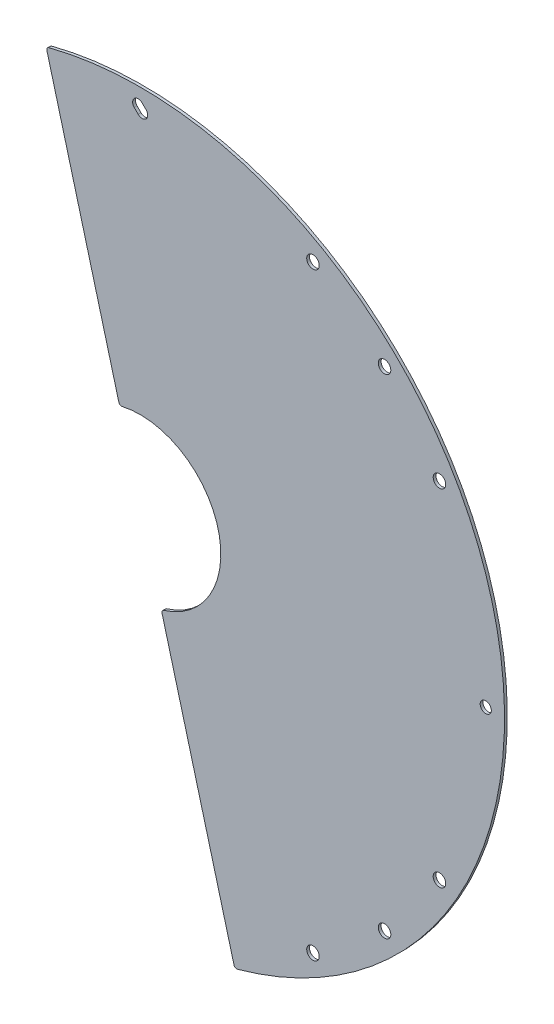
ISO-10303-21;
HEADER;
FILE_DESCRIPTION(('STEP AP214'),'2;1');
FILE_NAME('part.step','',(''),(''),'','','');
FILE_SCHEMA(('AUTOMOTIVE_DESIGN { 1 0 10303 214 1 1 1 1 }'));
ENDSEC;
DATA;
#1=APPLICATION_CONTEXT('core data for automotive mechanical design processes');
#2=APPLICATION_PROTOCOL_DEFINITION('international standard','automotive_design',2000,#1);
#3=PRODUCT_CONTEXT('',#1,'mechanical');
#4=PRODUCT('Part','Part','',(#3));
#5=PRODUCT_RELATED_PRODUCT_CATEGORY('part','',(#4));
#6=PRODUCT_DEFINITION_FORMATION('','',#4);
#7=PRODUCT_DEFINITION_CONTEXT('part definition',#1,'design');
#8=PRODUCT_DEFINITION('design','',#6,#7);
#9=PRODUCT_DEFINITION_SHAPE('','',#8);
#10=(LENGTH_UNIT() NAMED_UNIT(*) SI_UNIT(.MILLI.,.METRE.));
#11=(NAMED_UNIT(*) PLANE_ANGLE_UNIT() SI_UNIT($,.RADIAN.));
#12=(NAMED_UNIT(*) SI_UNIT($,.STERADIAN.) SOLID_ANGLE_UNIT());
#13=UNCERTAINTY_MEASURE_WITH_UNIT(LENGTH_MEASURE(1.E-05),#10,'distance_accuracy_value','');
#14=(GEOMETRIC_REPRESENTATION_CONTEXT(3) GLOBAL_UNCERTAINTY_ASSIGNED_CONTEXT((#13)) GLOBAL_UNIT_ASSIGNED_CONTEXT((#10,
#11,#12)) REPRESENTATION_CONTEXT('',''));
#15=CARTESIAN_POINT('',(0.,0.,0.));
#16=DIRECTION('',(0.,0.,1.));
#17=DIRECTION('',(1.,0.,0.));
#18=AXIS2_PLACEMENT_3D('',#15,#16,#17);
#19=CARTESIAN_POINT('',(-33.9052949084303,126.536283243868,0.999999999999994));
#20=DIRECTION('',(0.,0.,1.));
#21=DIRECTION('',(1.,0.,0.));
#22=AXIS2_PLACEMENT_3D('',#19,#20,#21);
#23=PLANE('',#22);
#24=CARTESIAN_POINT('',(0.,0.,0.999999999999987));
#25=DIRECTION('',(0.,0.,-1.));
#26=DIRECTION('',(-1.,0.,0.));
#27=AXIS2_PLACEMENT_3D('',#24,#25,#26);
#28=CIRCLE('',#27,29.);
#29=CARTESIAN_POINT('',(-6.473603948856,28.2682233596906,0.999999999999987));
#30=VERTEX_POINT('',#29);
#31=CARTESIAN_POINT('',(8.52780620609657,-27.7178015237728,0.999999999999987));
#32=VERTEX_POINT('',#31);
#33=EDGE_CURVE('E214',#30,#32,#28,.T.);
#34=ORIENTED_EDGE('',*,*,#33,.T.);
#35=CARTESIAN_POINT('',(8.82186848906542,-28.6735877832132,0.999999999999994));
#36=DIRECTION('',(0.,0.,1.));
#37=DIRECTION('',(1.,0.,0.));
#38=AXIS2_PLACEMENT_3D('',#35,#36,#37);
#39=CIRCLE('',#38,1.);
#40=CARTESIAN_POINT('',(7.85594266277633,-28.9324068283157,0.999999999999994));
#41=VERTEX_POINT('',#40);
#42=EDGE_CURVE('E238',#32,#41,#39,.T.);
#43=ORIENTED_EDGE('',*,*,#42,.T.);
#44=DIRECTION('',(-0.258819045102518,0.965925826289069,0.));
#45=VECTOR('',#44,1.);
#46=CARTESIAN_POINT('',(-33.8087023258014,126.562165148378,0.999999999999994));
#47=LINE('',#46,#45);
#48=CARTESIAN_POINT('',(33.7418639203775,-125.539980162412,0.999999999999994));
#49=VERTEX_POINT('',#48);
#50=EDGE_CURVE('E268',#49,#41,#47,.T.);
#51=ORIENTED_EDGE('',*,*,#50,.F.);
#52=CARTESIAN_POINT('',(34.7077897466666,-125.281161117309,0.999999999999994));
#53=DIRECTION('',(0.,0.,1.));
#54=DIRECTION('',(1.,0.,0.));
#55=AXIS2_PLACEMENT_3D('',#52,#53,#54);
#56=CIRCLE('',#55,1.);
#57=CARTESIAN_POINT('',(34.9747727447179,-126.244862356673,1.));
#58=VERTEX_POINT('',#57);
#59=EDGE_CURVE('E234',#49,#58,#56,.T.);
#60=ORIENTED_EDGE('',*,*,#59,.T.);
#61=CARTESIAN_POINT('',(0.,0.,1.));
#62=DIRECTION('',(0.,0.,-1.));
#63=DIRECTION('',(-1.,0.,0.));
#64=AXIS2_PLACEMENT_3D('',#61,#62,#63);
#65=CIRCLE('',#64,131.);
#66=CARTESIAN_POINT('',(-32.8333894898225,126.818644270508,1.));
#67=VERTEX_POINT('',#66);
#68=EDGE_CURVE('E223',#67,#58,#65,.T.);
#69=ORIENTED_EDGE('',*,*,#68,.F.);
#70=CARTESIAN_POINT('',(-32.5827529288315,125.850563016535,0.999999999999994));
#71=DIRECTION('',(0.,0.,1.));
#72=DIRECTION('',(1.,0.,0.));
#73=AXIS2_PLACEMENT_3D('',#70,#71,#72);
#74=CIRCLE('',#73,1.);
#75=CARTESIAN_POINT('',(-33.5486787551206,125.591743971432,0.999999999999994));
#76=VERTEX_POINT('',#75);
#77=EDGE_CURVE('E232',#67,#76,#74,.T.);
#78=ORIENTED_EDGE('',*,*,#77,.T.);
#79=CARTESIAN_POINT('',(-7.66275749751943,28.984170637336,0.999999999999994));
#80=VERTEX_POINT('',#79);
#81=EDGE_CURVE('E155',#80,#76,#47,.T.);
#82=ORIENTED_EDGE('',*,*,#81,.F.);
#83=CARTESIAN_POINT('',(-6.69683167123034,29.2429896824385,0.999999999999994));
#84=DIRECTION('',(0.,0.,1.));
#85=DIRECTION('',(1.,0.,0.));
#86=AXIS2_PLACEMENT_3D('',#83,#84,#85);
#87=CIRCLE('',#86,1.);
#88=EDGE_CURVE('E236',#80,#30,#87,.T.);
#89=ORIENTED_EDGE('',*,*,#88,.T.);
#90=EDGE_LOOP('',(#34,#43,#51,#60,#69,#78,#82,#89));
#91=FACE_BOUND('',#90,.T.);
#92=DIRECTION('',(-0.707106781186549,0.707106781186546,0.));
#93=VECTOR('',#92,1.);
#94=CARTESIAN_POINT('',(0.70710678118611,126.37132034356,0.999999999999994));
#95=LINE('',#94,#93);
#96=CARTESIAN_POINT('',(2.12132034355921,124.957106781187,0.999999999999994));
#97=VERTEX_POINT('',#96);
#98=CARTESIAN_POINT('',(0.70710678118611,126.37132034356,0.999999999999994));
#99=VERTEX_POINT('',#98);
#100=EDGE_CURVE('E150',#97,#99,#95,.T.);
#101=ORIENTED_EDGE('',*,*,#100,.F.);
#102=CARTESIAN_POINT('',(0.707106781186083,123.542893218813,0.999999999999994));
#103=DIRECTION('',(0.,0.,1.));
#104=DIRECTION('',(1.,0.,0.));
#105=AXIS2_PLACEMENT_3D('',#102,#103,#104);
#106=CIRCLE('',#105,1.99999999999999);
#107=CARTESIAN_POINT('',(-0.707106781187008,122.12867965644,0.999999999999994));
#108=VERTEX_POINT('',#107);
#109=EDGE_CURVE('E152',#108,#97,#106,.T.);
#110=ORIENTED_EDGE('',*,*,#109,.F.);
#111=DIRECTION('',(0.707106781186547,-0.707106781186547,0.));
#112=VECTOR('',#111,1.);
#113=CARTESIAN_POINT('',(-2.12132034356007,123.542893218813,0.999999999999994));
#114=LINE('',#113,#112);
#115=CARTESIAN_POINT('',(-2.12132034356007,123.542893218813,0.999999999999994));
#116=VERTEX_POINT('',#115);
#117=EDGE_CURVE('E161',#116,#108,#114,.T.);
#118=ORIENTED_EDGE('',*,*,#117,.F.);
#119=CARTESIAN_POINT('',(-0.707106781187007,124.957106781187,0.999999999999994));
#120=DIRECTION('',(0.,0.,1.));
#121=DIRECTION('',(1.,0.,0.));
#122=AXIS2_PLACEMENT_3D('',#119,#120,#121);
#123=CIRCLE('',#122,1.99999999999999);
#124=EDGE_CURVE('E144',#99,#116,#123,.T.);
#125=ORIENTED_EDGE('',*,*,#124,.F.);
#126=EDGE_LOOP('',(#101,#110,#118,#125));
#127=FACE_BOUND('',#126,.T.);
#128=CARTESIAN_POINT('',(87.8580175624287,-87.8580175624283,0.999999999999995));
#129=DIRECTION('',(0.,0.,1.));
#130=DIRECTION('',(1.,0.,0.));
#131=AXIS2_PLACEMENT_3D('',#128,#129,#130);
#132=CIRCLE('',#131,2.24999999999999);
#133=CARTESIAN_POINT('',(90.1080175624287,-87.8580175624283,0.999999999999995));
#134=VERTEX_POINT('',#133);
#135=EDGE_CURVE('E168',#134,#134,#132,.T.);
#136=ORIENTED_EDGE('',*,*,#135,.F.);
#137=EDGE_LOOP('',(#136));
#138=FACE_BOUND('',#137,.T.);
#139=CARTESIAN_POINT('',(87.858017562428,87.858017562429,0.999999999999995));
#140=DIRECTION('',(0.,0.,1.));
#141=DIRECTION('',(1.,0.,0.));
#142=AXIS2_PLACEMENT_3D('',#139,#140,#141);
#143=CIRCLE('',#142,2.24999999999999);
#144=CARTESIAN_POINT('',(90.108017562428,87.858017562429,0.999999999999995));
#145=VERTEX_POINT('',#144);
#146=EDGE_CURVE('E178',#145,#145,#143,.T.);
#147=ORIENTED_EDGE('',*,*,#146,.F.);
#148=EDGE_LOOP('',(#147));
#149=FACE_BOUND('',#148,.T.);
#150=CARTESIAN_POINT('',(124.25,0.,0.999999999999994));
#151=DIRECTION('',(0.,0.,1.));
#152=DIRECTION('',(1.,0.,0.));
#153=AXIS2_PLACEMENT_3D('',#150,#151,#152);
#154=CIRCLE('',#153,2.);
#155=CARTESIAN_POINT('',(126.25,0.,0.999999999999994));
#156=VERTEX_POINT('',#155);
#157=EDGE_CURVE('E184',#156,#156,#154,.T.);
#158=ORIENTED_EDGE('',*,*,#157,.F.);
#159=EDGE_LOOP('',(#158));
#160=FACE_BOUND('',#159,.T.);
#161=CARTESIAN_POINT('',(107.603656420215,62.125000000002,0.999999999999995));
#162=DIRECTION('',(0.,0.,1.));
#163=DIRECTION('',(1.,0.,0.));
#164=AXIS2_PLACEMENT_3D('',#161,#162,#163);
#165=CIRCLE('',#164,2.24999999999999);
#166=CARTESIAN_POINT('',(109.853656420215,62.125000000002,0.999999999999995));
#167=VERTEX_POINT('',#166);
#168=EDGE_CURVE('E190',#167,#167,#165,.T.);
#169=ORIENTED_EDGE('',*,*,#168,.F.);
#170=EDGE_LOOP('',(#169));
#171=FACE_BOUND('',#170,.T.);
#172=CARTESIAN_POINT('',(107.603656420218,-62.1249999999982,0.999999999999995));
#173=DIRECTION('',(0.,0.,1.));
#174=DIRECTION('',(1.,0.,0.));
#175=AXIS2_PLACEMENT_3D('',#172,#173,#174);
#176=CIRCLE('',#175,2.24999999999999);
#177=CARTESIAN_POINT('',(109.853656420218,-62.1249999999982,0.999999999999995));
#178=VERTEX_POINT('',#177);
#179=EDGE_CURVE('E196',#178,#178,#176,.T.);
#180=ORIENTED_EDGE('',*,*,#179,.F.);
#181=EDGE_LOOP('',(#180));
#182=FACE_BOUND('',#181,.T.);
#183=CARTESIAN_POINT('',(62.1250000000016,-107.603656420216,0.999999999999995));
#184=DIRECTION('',(0.,0.,1.));
#185=DIRECTION('',(1.,0.,0.));
#186=AXIS2_PLACEMENT_3D('',#183,#184,#185);
#187=CIRCLE('',#186,2.24999999999999);
#188=CARTESIAN_POINT('',(64.3750000000016,-107.603656420216,0.999999999999995));
#189=VERTEX_POINT('',#188);
#190=EDGE_CURVE('E202',#189,#189,#187,.T.);
#191=ORIENTED_EDGE('',*,*,#190,.F.);
#192=EDGE_LOOP('',(#191));
#193=FACE_BOUND('',#192,.T.);
#194=CARTESIAN_POINT('',(62.1249999999993,107.603656420217,0.999999999999995));
#195=DIRECTION('',(0.,0.,1.));
#196=DIRECTION('',(1.,0.,0.));
#197=AXIS2_PLACEMENT_3D('',#194,#195,#196);
#198=CIRCLE('',#197,2.24999999999999);
#199=CARTESIAN_POINT('',(64.3749999999993,107.603656420217,0.999999999999995));
#200=VERTEX_POINT('',#199);
#201=EDGE_CURVE('E208',#200,#200,#198,.T.);
#202=ORIENTED_EDGE('',*,*,#201,.F.);
#203=EDGE_LOOP('',(#202));
#204=FACE_BOUND('',#203,.T.);
#205=ADVANCED_FACE('F35',(#91,#127,#138,#149,#160,#171,#182,#193,#204),#23,.T.);
#206=CARTESIAN_POINT('',(0.,0.,0.));
#207=DIRECTION('',(0.,0.,-1.));
#208=DIRECTION('',(-1.,0.,0.));
#209=AXIS2_PLACEMENT_3D('',#206,#207,#208);
#210=CYLINDRICAL_SURFACE('',#209,131.);
#211=ORIENTED_EDGE('',*,*,#68,.T.);
#212=DIRECTION('',(0.,0.,-1.));
#213=VECTOR('',#212,1.);
#214=CARTESIAN_POINT('',(34.9747727447179,-126.244862356673,0.));
#215=LINE('',#214,#213);
#216=CARTESIAN_POINT('',(34.9747727447179,-126.244862356673,0.));
#217=VERTEX_POINT('',#216);
#218=EDGE_CURVE('E11',#58,#217,#215,.T.);
#219=ORIENTED_EDGE('',*,*,#218,.T.);
#220=CARTESIAN_POINT('',(0.,0.,0.));
#221=DIRECTION('',(0.,0.,-1.));
#222=DIRECTION('',(-1.,0.,0.));
#223=AXIS2_PLACEMENT_3D('',#220,#221,#222);
#224=CIRCLE('',#223,131.);
#225=CARTESIAN_POINT('',(-32.8333894898225,126.818644270508,0.));
#226=VERTEX_POINT('',#225);
#227=EDGE_CURVE('E220',#226,#217,#224,.T.);
#228=ORIENTED_EDGE('',*,*,#227,.F.);
#229=DIRECTION('',(0.,0.,-1.));
#230=VECTOR('',#229,1.);
#231=CARTESIAN_POINT('',(-32.8333894898225,126.818644270508,0.));
#232=LINE('',#231,#230);
#233=EDGE_CURVE('E43',#226,#67,#232,.F.);
#234=ORIENTED_EDGE('',*,*,#233,.T.);
#235=EDGE_LOOP('',(#211,#219,#228,#234));
#236=FACE_BOUND('',#235,.T.);
#237=ADVANCED_FACE('F258',(#236),#210,.T.);
#238=CARTESIAN_POINT('',(-33.9052949084303,126.536283243868,0.));
#239=DIRECTION('',(0.,0.,1.));
#240=DIRECTION('',(1.,0.,0.));
#241=AXIS2_PLACEMENT_3D('',#238,#239,#240);
#242=PLANE('',#241);
#243=CARTESIAN_POINT('',(87.8580175624287,-87.8580175624283,0.));
#244=DIRECTION('',(0.,0.,1.));
#245=DIRECTION('',(1.,0.,0.));
#246=AXIS2_PLACEMENT_3D('',#243,#244,#245);
#247=CIRCLE('',#246,2.25);
#248=CARTESIAN_POINT('',(90.1080175624287,-87.8580175624283,0.));
#249=VERTEX_POINT('',#248);
#250=EDGE_CURVE('E175',#249,#249,#247,.T.);
#251=ORIENTED_EDGE('',*,*,#250,.T.);
#252=EDGE_LOOP('',(#251));
#253=FACE_BOUND('',#252,.T.);
#254=CARTESIAN_POINT('',(87.858017562428,87.858017562429,0.));
#255=DIRECTION('',(0.,0.,1.));
#256=DIRECTION('',(1.,0.,0.));
#257=AXIS2_PLACEMENT_3D('',#254,#255,#256);
#258=CIRCLE('',#257,2.25);
#259=CARTESIAN_POINT('',(90.108017562428,87.858017562429,0.));
#260=VERTEX_POINT('',#259);
#261=EDGE_CURVE('E181',#260,#260,#258,.T.);
#262=ORIENTED_EDGE('',*,*,#261,.T.);
#263=EDGE_LOOP('',(#262));
#264=FACE_BOUND('',#263,.T.);
#265=CARTESIAN_POINT('',(0.707106781186083,123.542893218813,0.));
#266=DIRECTION('',(0.,0.,1.));
#267=DIRECTION('',(1.,0.,0.));
#268=AXIS2_PLACEMENT_3D('',#265,#266,#267);
#269=CIRCLE('',#268,1.99999999999999);
#270=CARTESIAN_POINT('',(-0.707106781187006,122.12867965644,0.));
#271=VERTEX_POINT('',#270);
#272=CARTESIAN_POINT('',(2.12132034355921,124.957106781187,0.));
#273=VERTEX_POINT('',#272);
#274=EDGE_CURVE('E135',#271,#273,#269,.T.);
#275=ORIENTED_EDGE('',*,*,#274,.T.);
#276=DIRECTION('',(-0.707106781186549,0.707106781186546,0.));
#277=VECTOR('',#276,1.);
#278=CARTESIAN_POINT('',(0.70710678118611,126.37132034356,0.));
#279=LINE('',#278,#277);
#280=CARTESIAN_POINT('',(0.70710678118611,126.37132034356,0.));
#281=VERTEX_POINT('',#280);
#282=EDGE_CURVE('E146',#273,#281,#279,.T.);
#283=ORIENTED_EDGE('',*,*,#282,.T.);
#284=CARTESIAN_POINT('',(-0.707106781187007,124.957106781187,0.));
#285=DIRECTION('',(0.,0.,1.));
#286=DIRECTION('',(1.,0.,0.));
#287=AXIS2_PLACEMENT_3D('',#284,#285,#286);
#288=CIRCLE('',#287,1.99999999999999);
#289=CARTESIAN_POINT('',(-2.12132034356007,123.542893218813,0.));
#290=VERTEX_POINT('',#289);
#291=EDGE_CURVE('E136',#281,#290,#288,.T.);
#292=ORIENTED_EDGE('',*,*,#291,.T.);
#293=DIRECTION('',(0.707106781186547,-0.707106781186547,0.));
#294=VECTOR('',#293,1.);
#295=CARTESIAN_POINT('',(-2.12132034356007,123.542893218813,0.));
#296=LINE('',#295,#294);
#297=EDGE_CURVE('E125',#290,#271,#296,.T.);
#298=ORIENTED_EDGE('',*,*,#297,.T.);
#299=EDGE_LOOP('',(#275,#283,#292,#298));
#300=FACE_BOUND('',#299,.T.);
#301=CARTESIAN_POINT('',(124.25,0.,0.));
#302=DIRECTION('',(0.,0.,1.));
#303=DIRECTION('',(1.,0.,0.));
#304=AXIS2_PLACEMENT_3D('',#301,#302,#303);
#305=CIRCLE('',#304,2.);
#306=CARTESIAN_POINT('',(126.25,0.,0.));
#307=VERTEX_POINT('',#306);
#308=EDGE_CURVE('E187',#307,#307,#305,.T.);
#309=ORIENTED_EDGE('',*,*,#308,.T.);
#310=EDGE_LOOP('',(#309));
#311=FACE_BOUND('',#310,.T.);
#312=CARTESIAN_POINT('',(107.603656420215,62.125000000002,0.));
#313=DIRECTION('',(0.,0.,1.));
#314=DIRECTION('',(1.,0.,0.));
#315=AXIS2_PLACEMENT_3D('',#312,#313,#314);
#316=CIRCLE('',#315,2.25);
#317=CARTESIAN_POINT('',(109.853656420215,62.125000000002,0.));
#318=VERTEX_POINT('',#317);
#319=EDGE_CURVE('E193',#318,#318,#316,.T.);
#320=ORIENTED_EDGE('',*,*,#319,.T.);
#321=EDGE_LOOP('',(#320));
#322=FACE_BOUND('',#321,.T.);
#323=CARTESIAN_POINT('',(107.603656420218,-62.1249999999982,0.));
#324=DIRECTION('',(0.,0.,1.));
#325=DIRECTION('',(1.,0.,0.));
#326=AXIS2_PLACEMENT_3D('',#323,#324,#325);
#327=CIRCLE('',#326,2.25);
#328=CARTESIAN_POINT('',(109.853656420218,-62.1249999999982,0.));
#329=VERTEX_POINT('',#328);
#330=EDGE_CURVE('E199',#329,#329,#327,.T.);
#331=ORIENTED_EDGE('',*,*,#330,.T.);
#332=EDGE_LOOP('',(#331));
#333=FACE_BOUND('',#332,.T.);
#334=CARTESIAN_POINT('',(62.1250000000016,-107.603656420216,0.));
#335=DIRECTION('',(0.,0.,1.));
#336=DIRECTION('',(1.,0.,0.));
#337=AXIS2_PLACEMENT_3D('',#334,#335,#336);
#338=CIRCLE('',#337,2.25);
#339=CARTESIAN_POINT('',(64.3750000000016,-107.603656420216,0.));
#340=VERTEX_POINT('',#339);
#341=EDGE_CURVE('E205',#340,#340,#338,.T.);
#342=ORIENTED_EDGE('',*,*,#341,.T.);
#343=EDGE_LOOP('',(#342));
#344=FACE_BOUND('',#343,.T.);
#345=CARTESIAN_POINT('',(62.1249999999993,107.603656420217,0.));
#346=DIRECTION('',(0.,0.,1.));
#347=DIRECTION('',(1.,0.,0.));
#348=AXIS2_PLACEMENT_3D('',#345,#346,#347);
#349=CIRCLE('',#348,2.25);
#350=CARTESIAN_POINT('',(64.3749999999993,107.603656420217,0.));
#351=VERTEX_POINT('',#350);
#352=EDGE_CURVE('E211',#351,#351,#349,.T.);
#353=ORIENTED_EDGE('',*,*,#352,.T.);
#354=EDGE_LOOP('',(#353));
#355=FACE_BOUND('',#354,.T.);
#356=DIRECTION('',(-0.258819045102518,0.965925826289069,0.));
#357=VECTOR('',#356,1.);
#358=CARTESIAN_POINT('',(-33.8087023258014,126.562165148378,0.));
#359=LINE('',#358,#357);
#360=CARTESIAN_POINT('',(33.7418639203775,-125.539980162412,0.));
#361=VERTEX_POINT('',#360);
#362=CARTESIAN_POINT('',(7.85594266277633,-28.9324068283157,0.));
#363=VERTEX_POINT('',#362);
#364=EDGE_CURVE('E162',#361,#363,#359,.T.);
#365=ORIENTED_EDGE('',*,*,#364,.T.);
#366=CARTESIAN_POINT('',(8.82186848906542,-28.6735877832132,0.));
#367=DIRECTION('',(0.,0.,1.));
#368=DIRECTION('',(1.,0.,0.));
#369=AXIS2_PLACEMENT_3D('',#366,#367,#368);
#370=CIRCLE('',#369,1.);
#371=CARTESIAN_POINT('',(8.52780620609657,-27.7178015237728,0.));
#372=VERTEX_POINT('',#371);
#373=EDGE_CURVE('E249',#363,#372,#370,.F.);
#374=ORIENTED_EDGE('',*,*,#373,.T.);
#375=CARTESIAN_POINT('',(0.,0.,0.));
#376=DIRECTION('',(0.,0.,-1.));
#377=DIRECTION('',(-1.,0.,0.));
#378=AXIS2_PLACEMENT_3D('',#375,#376,#377);
#379=CIRCLE('',#378,29.);
#380=CARTESIAN_POINT('',(-6.473603948856,28.2682233596906,0.));
#381=VERTEX_POINT('',#380);
#382=EDGE_CURVE('E217',#381,#372,#379,.T.);
#383=ORIENTED_EDGE('',*,*,#382,.F.);
#384=CARTESIAN_POINT('',(-6.69683167123034,29.2429896824385,0.));
#385=DIRECTION('',(0.,0.,1.));
#386=DIRECTION('',(1.,0.,0.));
#387=AXIS2_PLACEMENT_3D('',#384,#385,#386);
#388=CIRCLE('',#387,1.);
#389=CARTESIAN_POINT('',(-7.66275749751943,28.984170637336,0.));
#390=VERTEX_POINT('',#389);
#391=EDGE_CURVE('E57',#381,#390,#388,.F.);
#392=ORIENTED_EDGE('',*,*,#391,.T.);
#393=CARTESIAN_POINT('',(-33.5486787551206,125.591743971432,0.));
#394=VERTEX_POINT('',#393);
#395=EDGE_CURVE('E274',#390,#394,#359,.T.);
#396=ORIENTED_EDGE('',*,*,#395,.T.);
#397=CARTESIAN_POINT('',(-32.5827529288315,125.850563016535,0.));
#398=DIRECTION('',(0.,0.,1.));
#399=DIRECTION('',(1.,0.,0.));
#400=AXIS2_PLACEMENT_3D('',#397,#398,#399);
#401=CIRCLE('',#400,1.);
#402=EDGE_CURVE('E244',#394,#226,#401,.F.);
#403=ORIENTED_EDGE('',*,*,#402,.T.);
#404=ORIENTED_EDGE('',*,*,#227,.T.);
#405=CARTESIAN_POINT('',(34.7077897466666,-125.281161117309,0.));
#406=DIRECTION('',(0.,0.,1.));
#407=DIRECTION('',(1.,0.,0.));
#408=AXIS2_PLACEMENT_3D('',#405,#406,#407);
#409=CIRCLE('',#408,1.);
#410=EDGE_CURVE('E246',#217,#361,#409,.F.);
#411=ORIENTED_EDGE('',*,*,#410,.T.);
#412=EDGE_LOOP('',(#365,#374,#383,#392,#396,#403,#404,#411));
#413=FACE_BOUND('',#412,.T.);
#414=ADVANCED_FACE('F148',(#253,#264,#300,#311,#322,#333,#344,#355,#413),#242,.F.);
#415=CARTESIAN_POINT('',(0.,0.,0.));
#416=DIRECTION('',(0.,0.,-1.));
#417=DIRECTION('',(-1.,0.,0.));
#418=AXIS2_PLACEMENT_3D('',#415,#416,#417);
#419=CYLINDRICAL_SURFACE('',#418,29.);
#420=ORIENTED_EDGE('',*,*,#382,.T.);
#421=DIRECTION('',(0.,0.,-1.));
#422=VECTOR('',#421,1.);
#423=CARTESIAN_POINT('',(8.52780620609657,-27.7178015237728,0.));
#424=LINE('',#423,#422);
#425=EDGE_CURVE('E229',#372,#32,#424,.F.);
#426=ORIENTED_EDGE('',*,*,#425,.T.);
#427=ORIENTED_EDGE('',*,*,#33,.F.);
#428=DIRECTION('',(0.,0.,-1.));
#429=VECTOR('',#428,1.);
#430=CARTESIAN_POINT('',(-6.473603948856,28.2682233596906,0.));
#431=LINE('',#430,#429);
#432=EDGE_CURVE('E226',#30,#381,#431,.T.);
#433=ORIENTED_EDGE('',*,*,#432,.T.);
#434=EDGE_LOOP('',(#420,#426,#427,#433));
#435=FACE_BOUND('',#434,.T.);
#436=ADVANCED_FACE('F290',(#435),#419,.F.);
#437=CARTESIAN_POINT('',(62.1249999999993,107.603656420217,0.999999999999994));
#438=DIRECTION('',(0.,0.,1.));
#439=DIRECTION('',(1.,0.,0.));
#440=AXIS2_PLACEMENT_3D('',#437,#438,#439);
#441=CYLINDRICAL_SURFACE('',#440,2.25);
#442=ORIENTED_EDGE('',*,*,#352,.F.);
#443=EDGE_LOOP('',(#442));
#444=FACE_BOUND('',#443,.T.);
#445=ORIENTED_EDGE('',*,*,#201,.T.);
#446=EDGE_LOOP('',(#445));
#447=FACE_BOUND('',#446,.T.);
#448=ADVANCED_FACE('F288',(#444,#447),#441,.F.);
#449=CARTESIAN_POINT('',(62.1250000000016,-107.603656420216,0.999999999999994));
#450=DIRECTION('',(0.,0.,1.));
#451=DIRECTION('',(1.,0.,0.));
#452=AXIS2_PLACEMENT_3D('',#449,#450,#451);
#453=CYLINDRICAL_SURFACE('',#452,2.25);
#454=ORIENTED_EDGE('',*,*,#341,.F.);
#455=EDGE_LOOP('',(#454));
#456=FACE_BOUND('',#455,.T.);
#457=ORIENTED_EDGE('',*,*,#190,.T.);
#458=EDGE_LOOP('',(#457));
#459=FACE_BOUND('',#458,.T.);
#460=ADVANCED_FACE('F351',(#456,#459),#453,.F.);
#461=CARTESIAN_POINT('',(107.603656420218,-62.1249999999982,0.999999999999994));
#462=DIRECTION('',(0.,0.,1.));
#463=DIRECTION('',(1.,0.,0.));
#464=AXIS2_PLACEMENT_3D('',#461,#462,#463);
#465=CYLINDRICAL_SURFACE('',#464,2.25);
#466=ORIENTED_EDGE('',*,*,#330,.F.);
#467=EDGE_LOOP('',(#466));
#468=FACE_BOUND('',#467,.T.);
#469=ORIENTED_EDGE('',*,*,#179,.T.);
#470=EDGE_LOOP('',(#469));
#471=FACE_BOUND('',#470,.T.);
#472=ADVANCED_FACE('F348',(#468,#471),#465,.F.);
#473=CARTESIAN_POINT('',(107.603656420215,62.125000000002,0.999999999999994));
#474=DIRECTION('',(0.,0.,1.));
#475=DIRECTION('',(1.,0.,0.));
#476=AXIS2_PLACEMENT_3D('',#473,#474,#475);
#477=CYLINDRICAL_SURFACE('',#476,2.25);
#478=ORIENTED_EDGE('',*,*,#319,.F.);
#479=EDGE_LOOP('',(#478));
#480=FACE_BOUND('',#479,.T.);
#481=ORIENTED_EDGE('',*,*,#168,.T.);
#482=EDGE_LOOP('',(#481));
#483=FACE_BOUND('',#482,.T.);
#484=ADVANCED_FACE('F344',(#480,#483),#477,.F.);
#485=CARTESIAN_POINT('',(124.25,0.,0.999999999999994));
#486=DIRECTION('',(0.,0.,1.));
#487=DIRECTION('',(1.,0.,0.));
#488=AXIS2_PLACEMENT_3D('',#485,#486,#487);
#489=CYLINDRICAL_SURFACE('',#488,2.);
#490=ORIENTED_EDGE('',*,*,#308,.F.);
#491=EDGE_LOOP('',(#490));
#492=FACE_BOUND('',#491,.T.);
#493=ORIENTED_EDGE('',*,*,#157,.T.);
#494=EDGE_LOOP('',(#493));
#495=FACE_BOUND('',#494,.T.);
#496=ADVANCED_FACE('F340',(#492,#495),#489,.F.);
#497=CARTESIAN_POINT('',(87.858017562428,87.858017562429,0.999999999999994));
#498=DIRECTION('',(0.,0.,1.));
#499=DIRECTION('',(1.,0.,0.));
#500=AXIS2_PLACEMENT_3D('',#497,#498,#499);
#501=CYLINDRICAL_SURFACE('',#500,2.25);
#502=ORIENTED_EDGE('',*,*,#261,.F.);
#503=EDGE_LOOP('',(#502));
#504=FACE_BOUND('',#503,.T.);
#505=ORIENTED_EDGE('',*,*,#146,.T.);
#506=EDGE_LOOP('',(#505));
#507=FACE_BOUND('',#506,.T.);
#508=ADVANCED_FACE('F336',(#504,#507),#501,.F.);
#509=CARTESIAN_POINT('',(87.8580175624287,-87.8580175624283,0.999999999999994));
#510=DIRECTION('',(0.,0.,1.));
#511=DIRECTION('',(1.,0.,0.));
#512=AXIS2_PLACEMENT_3D('',#509,#510,#511);
#513=CYLINDRICAL_SURFACE('',#512,2.25);
#514=ORIENTED_EDGE('',*,*,#250,.F.);
#515=EDGE_LOOP('',(#514));
#516=FACE_BOUND('',#515,.T.);
#517=ORIENTED_EDGE('',*,*,#135,.T.);
#518=EDGE_LOOP('',(#517));
#519=FACE_BOUND('',#518,.T.);
#520=ADVANCED_FACE('F327',(#516,#519),#513,.F.);
#521=CARTESIAN_POINT('',(0.70710678118611,126.37132034356,0.));
#522=DIRECTION('',(0.707106781186546,0.707106781186549,0.));
#523=DIRECTION('',(-0.707106781186549,0.707106781186546,0.));
#524=AXIS2_PLACEMENT_3D('',#521,#522,#523);
#525=PLANE('',#524);
#526=ORIENTED_EDGE('',*,*,#100,.T.);
#527=DIRECTION('',(0.,0.,1.));
#528=VECTOR('',#527,1.);
#529=CARTESIAN_POINT('',(0.70710678118611,126.37132034356,0.));
#530=LINE('',#529,#528);
#531=EDGE_CURVE('E166',#281,#99,#530,.T.);
#532=ORIENTED_EDGE('',*,*,#531,.F.);
#533=ORIENTED_EDGE('',*,*,#282,.F.);
#534=DIRECTION('',(0.,0.,1.));
#535=VECTOR('',#534,1.);
#536=CARTESIAN_POINT('',(2.12132034355921,124.957106781187,0.));
#537=LINE('',#536,#535);
#538=EDGE_CURVE('E169',#273,#97,#537,.T.);
#539=ORIENTED_EDGE('',*,*,#538,.T.);
#540=EDGE_LOOP('',(#526,#532,#533,#539));
#541=FACE_BOUND('',#540,.T.);
#542=ADVANCED_FACE('F325',(#541),#525,.F.);
#543=CARTESIAN_POINT('',(-2.12132034356007,123.542893218813,0.));
#544=DIRECTION('',(-0.707106781186547,-0.707106781186547,0.));
#545=DIRECTION('',(0.707106781186548,-0.707106781186548,0.));
#546=AXIS2_PLACEMENT_3D('',#543,#544,#545);
#547=PLANE('',#546);
#548=ORIENTED_EDGE('',*,*,#117,.T.);
#549=DIRECTION('',(0.,0.,1.));
#550=VECTOR('',#549,1.);
#551=CARTESIAN_POINT('',(-0.707106781187008,122.12867965644,0.));
#552=LINE('',#551,#550);
#553=EDGE_CURVE('E131',#271,#108,#552,.T.);
#554=ORIENTED_EDGE('',*,*,#553,.F.);
#555=ORIENTED_EDGE('',*,*,#297,.F.);
#556=DIRECTION('',(0.,0.,1.));
#557=VECTOR('',#556,1.);
#558=CARTESIAN_POINT('',(-2.12132034356007,123.542893218813,0.));
#559=LINE('',#558,#557);
#560=EDGE_CURVE('E128',#290,#116,#559,.T.);
#561=ORIENTED_EDGE('',*,*,#560,.T.);
#562=EDGE_LOOP('',(#548,#554,#555,#561));
#563=FACE_BOUND('',#562,.T.);
#564=ADVANCED_FACE('F127',(#563),#547,.F.);
#565=CARTESIAN_POINT('',(-0.707106781187007,124.957106781187,0.));
#566=DIRECTION('',(0.,0.,1.));
#567=DIRECTION('',(1.,0.,0.));
#568=AXIS2_PLACEMENT_3D('',#565,#566,#567);
#569=CYLINDRICAL_SURFACE('',#568,1.99999999999999);
#570=ORIENTED_EDGE('',*,*,#124,.T.);
#571=ORIENTED_EDGE('',*,*,#560,.F.);
#572=ORIENTED_EDGE('',*,*,#291,.F.);
#573=ORIENTED_EDGE('',*,*,#531,.T.);
#574=EDGE_LOOP('',(#570,#571,#572,#573));
#575=FACE_BOUND('',#574,.T.);
#576=ADVANCED_FACE('F140',(#575),#569,.F.);
#577=CARTESIAN_POINT('',(0.707106781186083,123.542893218813,0.));
#578=DIRECTION('',(0.,0.,1.));
#579=DIRECTION('',(1.,0.,0.));
#580=AXIS2_PLACEMENT_3D('',#577,#578,#579);
#581=CYLINDRICAL_SURFACE('',#580,1.99999999999999);
#582=ORIENTED_EDGE('',*,*,#109,.T.);
#583=ORIENTED_EDGE('',*,*,#538,.F.);
#584=ORIENTED_EDGE('',*,*,#274,.F.);
#585=ORIENTED_EDGE('',*,*,#553,.T.);
#586=EDGE_LOOP('',(#582,#583,#584,#585));
#587=FACE_BOUND('',#586,.T.);
#588=ADVANCED_FACE('F316',(#587),#581,.F.);
#589=CARTESIAN_POINT('',(-33.8087023258014,126.562165148378,0.));
#590=DIRECTION('',(0.965925826289069,0.258819045102518,0.));
#591=DIRECTION('',(-0.258819045102518,0.965925826289069,0.));
#592=AXIS2_PLACEMENT_3D('',#589,#590,#591);
#593=PLANE('',#592);
#594=ORIENTED_EDGE('',*,*,#395,.F.);
#595=DIRECTION('',(0.,0.,-1.));
#596=VECTOR('',#595,1.);
#597=CARTESIAN_POINT('',(-7.66275749751941,28.984170637336,0.));
#598=LINE('',#597,#596);
#599=EDGE_CURVE('E252',#390,#80,#598,.F.);
#600=ORIENTED_EDGE('',*,*,#599,.T.);
#601=ORIENTED_EDGE('',*,*,#81,.T.);
#602=DIRECTION('',(0.,0.,-1.));
#603=VECTOR('',#602,1.);
#604=CARTESIAN_POINT('',(-33.5486787551206,125.591743971432,0.));
#605=LINE('',#604,#603);
#606=EDGE_CURVE('E50',#76,#394,#605,.T.);
#607=ORIENTED_EDGE('',*,*,#606,.T.);
#608=EDGE_LOOP('',(#594,#600,#601,#607));
#609=FACE_BOUND('',#608,.T.);
#610=ADVANCED_FACE('F314',(#609),#593,.F.);
#611=ORIENTED_EDGE('',*,*,#50,.T.);
#612=DIRECTION('',(0.,0.,-1.));
#613=VECTOR('',#612,1.);
#614=CARTESIAN_POINT('',(7.85594266277634,-28.9324068283157,0.));
#615=LINE('',#614,#613);
#616=EDGE_CURVE('E242',#41,#363,#615,.T.);
#617=ORIENTED_EDGE('',*,*,#616,.T.);
#618=ORIENTED_EDGE('',*,*,#364,.F.);
#619=DIRECTION('',(0.,0.,-1.));
#620=VECTOR('',#619,1.);
#621=CARTESIAN_POINT('',(33.7418639203775,-125.539980162412,0.));
#622=LINE('',#621,#620);
#623=EDGE_CURVE('E240',#361,#49,#622,.F.);
#624=ORIENTED_EDGE('',*,*,#623,.T.);
#625=EDGE_LOOP('',(#611,#617,#618,#624));
#626=FACE_BOUND('',#625,.T.);
#627=ADVANCED_FACE('F300',(#626),#593,.F.);
#628=CARTESIAN_POINT('',(8.82186848906542,-28.6735877832132,0.));
#629=DIRECTION('',(0.,0.,-1.));
#630=DIRECTION('',(-1.,0.,0.));
#631=AXIS2_PLACEMENT_3D('',#628,#629,#630);
#632=CYLINDRICAL_SURFACE('',#631,1.);
#633=ORIENTED_EDGE('',*,*,#373,.F.);
#634=ORIENTED_EDGE('',*,*,#616,.F.);
#635=ORIENTED_EDGE('',*,*,#42,.F.);
#636=ORIENTED_EDGE('',*,*,#425,.F.);
#637=EDGE_LOOP('',(#633,#634,#635,#636));
#638=FACE_BOUND('',#637,.T.);
#639=ADVANCED_FACE('F297',(#638),#632,.T.);
#640=CARTESIAN_POINT('',(-6.69683167123034,29.2429896824385,0.));
#641=DIRECTION('',(0.,0.,-1.));
#642=DIRECTION('',(-1.,0.,0.));
#643=AXIS2_PLACEMENT_3D('',#640,#641,#642);
#644=CYLINDRICAL_SURFACE('',#643,1.);
#645=ORIENTED_EDGE('',*,*,#88,.F.);
#646=ORIENTED_EDGE('',*,*,#599,.F.);
#647=ORIENTED_EDGE('',*,*,#391,.F.);
#648=ORIENTED_EDGE('',*,*,#432,.F.);
#649=EDGE_LOOP('',(#645,#646,#647,#648));
#650=FACE_BOUND('',#649,.T.);
#651=ADVANCED_FACE('F279',(#650),#644,.T.);
#652=CARTESIAN_POINT('',(34.7077897466666,-125.281161117309,0.));
#653=DIRECTION('',(0.,0.,-1.));
#654=DIRECTION('',(-1.,0.,0.));
#655=AXIS2_PLACEMENT_3D('',#652,#653,#654);
#656=CYLINDRICAL_SURFACE('',#655,1.);
#657=ORIENTED_EDGE('',*,*,#59,.F.);
#658=ORIENTED_EDGE('',*,*,#623,.F.);
#659=ORIENTED_EDGE('',*,*,#410,.F.);
#660=ORIENTED_EDGE('',*,*,#218,.F.);
#661=EDGE_LOOP('',(#657,#658,#659,#660));
#662=FACE_BOUND('',#661,.T.);
#663=ADVANCED_FACE('F271',(#662),#656,.T.);
#664=CARTESIAN_POINT('',(-32.5827529288315,125.850563016535,0.));
#665=DIRECTION('',(0.,0.,-1.));
#666=DIRECTION('',(-1.,0.,0.));
#667=AXIS2_PLACEMENT_3D('',#664,#665,#666);
#668=CYLINDRICAL_SURFACE('',#667,1.);
#669=ORIENTED_EDGE('',*,*,#402,.F.);
#670=ORIENTED_EDGE('',*,*,#606,.F.);
#671=ORIENTED_EDGE('',*,*,#77,.F.);
#672=ORIENTED_EDGE('',*,*,#233,.F.);
#673=EDGE_LOOP('',(#669,#670,#671,#672));
#674=FACE_BOUND('',#673,.T.);
#675=ADVANCED_FACE('F37',(#674),#668,.T.);
#676=CLOSED_SHELL('',(#205,#237,#414,#436,#448,#460,#472,#484,#496,#508,#520,#542,#564,#576,
#588,#610,#627,#639,#651,#663,#675));
#677=MANIFOLD_SOLID_BREP('B2',#676);
#678=ADVANCED_BREP_SHAPE_REPRESENTATION('',(#18,#677),#14);
#679=SHAPE_DEFINITION_REPRESENTATION(#9,#678);
ENDSEC;
END-ISO-10303-21;
